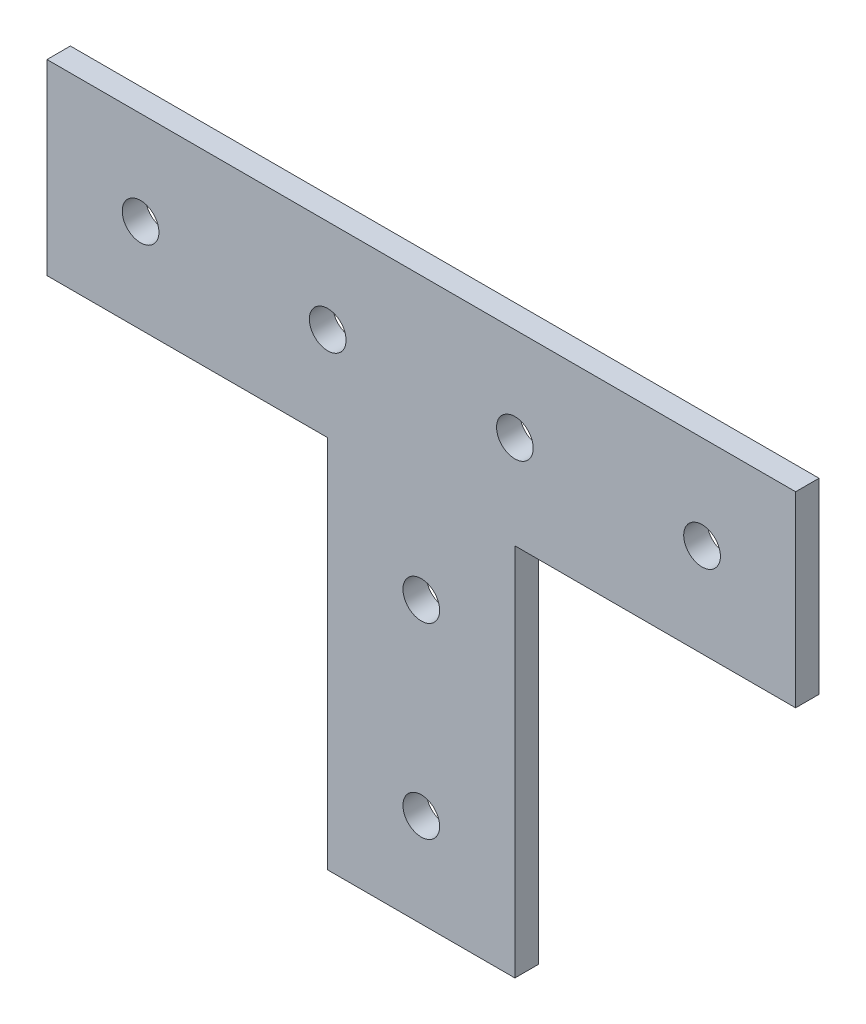
ISO-10303-21;
HEADER;
FILE_DESCRIPTION(('STEP AP214'),'2;1');
FILE_NAME('part.step','',(''),(''),'','','');
FILE_SCHEMA(('AUTOMOTIVE_DESIGN { 1 0 10303 214 1 1 1 1 }'));
ENDSEC;
DATA;
#1=APPLICATION_CONTEXT('core data for automotive mechanical design processes');
#2=APPLICATION_PROTOCOL_DEFINITION('international standard','automotive_design',2000,#1);
#3=PRODUCT_CONTEXT('',#1,'mechanical');
#4=PRODUCT('Part','Part','',(#3));
#5=PRODUCT_RELATED_PRODUCT_CATEGORY('part','',(#4));
#6=PRODUCT_DEFINITION_FORMATION('','',#4);
#7=PRODUCT_DEFINITION_CONTEXT('part definition',#1,'design');
#8=PRODUCT_DEFINITION('design','',#6,#7);
#9=PRODUCT_DEFINITION_SHAPE('','',#8);
#10=(LENGTH_UNIT() NAMED_UNIT(*) SI_UNIT(.MILLI.,.METRE.));
#11=(NAMED_UNIT(*) PLANE_ANGLE_UNIT() SI_UNIT($,.RADIAN.));
#12=(NAMED_UNIT(*) SI_UNIT($,.STERADIAN.) SOLID_ANGLE_UNIT());
#13=UNCERTAINTY_MEASURE_WITH_UNIT(LENGTH_MEASURE(1.E-05),#10,'distance_accuracy_value','');
#14=(GEOMETRIC_REPRESENTATION_CONTEXT(3) GLOBAL_UNCERTAINTY_ASSIGNED_CONTEXT((#13)) GLOBAL_UNIT_ASSIGNED_CONTEXT((#10,
#11,#12)) REPRESENTATION_CONTEXT('',''));
#15=CARTESIAN_POINT('',(0.,0.,0.));
#16=DIRECTION('',(0.,0.,1.));
#17=DIRECTION('',(1.,0.,0.));
#18=AXIS2_PLACEMENT_3D('',#15,#16,#17);
#19=CARTESIAN_POINT('',(0.,50.8,3.175));
#20=DIRECTION('',(0.,-1.,0.));
#21=DIRECTION('',(1.,0.,0.));
#22=AXIS2_PLACEMENT_3D('',#19,#20,#21);
#23=PLANE('',#22);
#24=DIRECTION('',(-1.,0.,0.));
#25=VECTOR('',#24,1.);
#26=CARTESIAN_POINT('',(0.,50.8,0.));
#27=LINE('',#26,#25);
#28=CARTESIAN_POINT('',(50.8,50.8,0.));
#29=VERTEX_POINT('',#28);
#30=CARTESIAN_POINT('',(-50.8,50.8,0.));
#31=VERTEX_POINT('',#30);
#32=EDGE_CURVE('E192',#29,#31,#27,.T.);
#33=ORIENTED_EDGE('',*,*,#32,.T.);
#34=DIRECTION('',(0.,0.,-1.));
#35=VECTOR('',#34,1.);
#36=CARTESIAN_POINT('',(-50.8,50.8,3.175));
#37=LINE('',#36,#35);
#38=CARTESIAN_POINT('',(-50.8,50.8,3.175));
#39=VERTEX_POINT('',#38);
#40=EDGE_CURVE('E11',#39,#31,#37,.T.);
#41=ORIENTED_EDGE('',*,*,#40,.F.);
#42=DIRECTION('',(-1.,0.,0.));
#43=VECTOR('',#42,1.);
#44=CARTESIAN_POINT('',(0.,50.8,3.175));
#45=LINE('',#44,#43);
#46=CARTESIAN_POINT('',(50.8,50.8,3.175));
#47=VERTEX_POINT('',#46);
#48=EDGE_CURVE('E140',#47,#39,#45,.T.);
#49=ORIENTED_EDGE('',*,*,#48,.F.);
#50=DIRECTION('',(0.,0.,-1.));
#51=VECTOR('',#50,1.);
#52=CARTESIAN_POINT('',(50.8,50.8,3.175));
#53=LINE('',#52,#51);
#54=EDGE_CURVE('E166',#47,#29,#53,.T.);
#55=ORIENTED_EDGE('',*,*,#54,.T.);
#56=EDGE_LOOP('',(#33,#41,#49,#55));
#57=FACE_BOUND('',#56,.T.);
#58=ADVANCED_FACE('F36',(#57),#23,.F.);
#59=CARTESIAN_POINT('',(-50.8,0.,3.175));
#60=DIRECTION('',(1.,0.,0.));
#61=DIRECTION('',(0.,0.,-1.));
#62=AXIS2_PLACEMENT_3D('',#59,#60,#61);
#63=PLANE('',#62);
#64=DIRECTION('',(0.,-1.,0.));
#65=VECTOR('',#64,1.);
#66=CARTESIAN_POINT('',(-50.8,0.,0.));
#67=LINE('',#66,#65);
#68=CARTESIAN_POINT('',(-50.8,25.4,0.));
#69=VERTEX_POINT('',#68);
#70=EDGE_CURVE('E185',#31,#69,#67,.T.);
#71=ORIENTED_EDGE('',*,*,#70,.T.);
#72=DIRECTION('',(0.,0.,-1.));
#73=VECTOR('',#72,1.);
#74=CARTESIAN_POINT('',(-50.8,25.4,3.175));
#75=LINE('',#74,#73);
#76=CARTESIAN_POINT('',(-50.8,25.4,3.175));
#77=VERTEX_POINT('',#76);
#78=EDGE_CURVE('E45',#77,#69,#75,.T.);
#79=ORIENTED_EDGE('',*,*,#78,.F.);
#80=DIRECTION('',(0.,-1.,0.));
#81=VECTOR('',#80,1.);
#82=CARTESIAN_POINT('',(-50.8,0.,3.175));
#83=LINE('',#82,#81);
#84=EDGE_CURVE('E96',#39,#77,#83,.T.);
#85=ORIENTED_EDGE('',*,*,#84,.F.);
#86=ORIENTED_EDGE('',*,*,#40,.T.);
#87=EDGE_LOOP('',(#71,#79,#85,#86));
#88=FACE_BOUND('',#87,.T.);
#89=ADVANCED_FACE('F240',(#88),#63,.F.);
#90=CARTESIAN_POINT('',(0.,25.4,3.175));
#91=DIRECTION('',(0.,1.,0.));
#92=DIRECTION('',(0.,0.,1.));
#93=AXIS2_PLACEMENT_3D('',#90,#91,#92);
#94=PLANE('',#93);
#95=DIRECTION('',(1.,0.,0.));
#96=VECTOR('',#95,1.);
#97=CARTESIAN_POINT('',(0.,25.4,0.));
#98=LINE('',#97,#96);
#99=CARTESIAN_POINT('',(-12.7,25.4,0.));
#100=VERTEX_POINT('',#99);
#101=EDGE_CURVE('E179',#69,#100,#98,.T.);
#102=ORIENTED_EDGE('',*,*,#101,.T.);
#103=DIRECTION('',(0.,0.,-1.));
#104=VECTOR('',#103,1.);
#105=CARTESIAN_POINT('',(-12.7,25.4,3.175));
#106=LINE('',#105,#104);
#107=CARTESIAN_POINT('',(-12.7,25.4,3.175));
#108=VERTEX_POINT('',#107);
#109=EDGE_CURVE('E173',#108,#100,#106,.T.);
#110=ORIENTED_EDGE('',*,*,#109,.F.);
#111=DIRECTION('',(1.,0.,0.));
#112=VECTOR('',#111,1.);
#113=CARTESIAN_POINT('',(0.,25.4,3.175));
#114=LINE('',#113,#112);
#115=EDGE_CURVE('E131',#77,#108,#114,.T.);
#116=ORIENTED_EDGE('',*,*,#115,.F.);
#117=ORIENTED_EDGE('',*,*,#78,.T.);
#118=EDGE_LOOP('',(#102,#110,#116,#117));
#119=FACE_BOUND('',#118,.T.);
#120=ADVANCED_FACE('F178',(#119),#94,.F.);
#121=CARTESIAN_POINT('',(-12.7,0.,3.175));
#122=DIRECTION('',(-1.,0.,0.));
#123=DIRECTION('',(0.,0.,1.));
#124=AXIS2_PLACEMENT_3D('',#121,#122,#123);
#125=PLANE('',#124);
#126=DIRECTION('',(0.,1.,0.));
#127=VECTOR('',#126,1.);
#128=CARTESIAN_POINT('',(-12.7,0.,0.));
#129=LINE('',#128,#127);
#130=CARTESIAN_POINT('',(-12.7,-25.4,0.));
#131=VERTEX_POINT('',#130);
#132=EDGE_CURVE('E188',#131,#100,#129,.T.);
#133=ORIENTED_EDGE('',*,*,#132,.F.);
#134=DIRECTION('',(0.,0.,-1.));
#135=VECTOR('',#134,1.);
#136=CARTESIAN_POINT('',(-12.7,-25.4,3.175));
#137=LINE('',#136,#135);
#138=CARTESIAN_POINT('',(-12.7,-25.4,3.175));
#139=VERTEX_POINT('',#138);
#140=EDGE_CURVE('E171',#139,#131,#137,.T.);
#141=ORIENTED_EDGE('',*,*,#140,.F.);
#142=DIRECTION('',(0.,1.,0.));
#143=VECTOR('',#142,1.);
#144=CARTESIAN_POINT('',(-12.7,0.,3.175));
#145=LINE('',#144,#143);
#146=EDGE_CURVE('E136',#139,#108,#145,.T.);
#147=ORIENTED_EDGE('',*,*,#146,.T.);
#148=ORIENTED_EDGE('',*,*,#109,.T.);
#149=EDGE_LOOP('',(#133,#141,#147,#148));
#150=FACE_BOUND('',#149,.T.);
#151=ADVANCED_FACE('F348',(#150),#125,.T.);
#152=CARTESIAN_POINT('',(0.,-25.4,3.175));
#153=DIRECTION('',(0.,1.,0.));
#154=DIRECTION('',(0.,0.,1.));
#155=AXIS2_PLACEMENT_3D('',#152,#153,#154);
#156=PLANE('',#155);
#157=DIRECTION('',(1.,0.,0.));
#158=VECTOR('',#157,1.);
#159=CARTESIAN_POINT('',(0.,-25.4,0.));
#160=LINE('',#159,#158);
#161=CARTESIAN_POINT('',(12.7,-25.4,0.));
#162=VERTEX_POINT('',#161);
#163=EDGE_CURVE('E190',#131,#162,#160,.T.);
#164=ORIENTED_EDGE('',*,*,#163,.T.);
#165=DIRECTION('',(0.,0.,-1.));
#166=VECTOR('',#165,1.);
#167=CARTESIAN_POINT('',(12.7,-25.4,3.175));
#168=LINE('',#167,#166);
#169=CARTESIAN_POINT('',(12.7,-25.4,3.175));
#170=VERTEX_POINT('',#169);
#171=EDGE_CURVE('E126',#170,#162,#168,.T.);
#172=ORIENTED_EDGE('',*,*,#171,.F.);
#173=DIRECTION('',(1.,0.,0.));
#174=VECTOR('',#173,1.);
#175=CARTESIAN_POINT('',(0.,-25.4,3.175));
#176=LINE('',#175,#174);
#177=EDGE_CURVE('E117',#139,#170,#176,.T.);
#178=ORIENTED_EDGE('',*,*,#177,.F.);
#179=ORIENTED_EDGE('',*,*,#140,.T.);
#180=EDGE_LOOP('',(#164,#172,#178,#179));
#181=FACE_BOUND('',#180,.T.);
#182=ADVANCED_FACE('F197',(#181),#156,.F.);
#183=CARTESIAN_POINT('',(12.7,0.,3.175));
#184=DIRECTION('',(-1.,0.,0.));
#185=DIRECTION('',(0.,0.,1.));
#186=AXIS2_PLACEMENT_3D('',#183,#184,#185);
#187=PLANE('',#186);
#188=DIRECTION('',(0.,1.,0.));
#189=VECTOR('',#188,1.);
#190=CARTESIAN_POINT('',(12.7,0.,0.));
#191=LINE('',#190,#189);
#192=CARTESIAN_POINT('',(12.7,25.4,0.));
#193=VERTEX_POINT('',#192);
#194=EDGE_CURVE('E125',#162,#193,#191,.T.);
#195=ORIENTED_EDGE('',*,*,#194,.T.);
#196=DIRECTION('',(0.,0.,-1.));
#197=VECTOR('',#196,1.);
#198=CARTESIAN_POINT('',(12.7,25.4,3.175));
#199=LINE('',#198,#197);
#200=CARTESIAN_POINT('',(12.7,25.4,3.175));
#201=VERTEX_POINT('',#200);
#202=EDGE_CURVE('E122',#201,#193,#199,.T.);
#203=ORIENTED_EDGE('',*,*,#202,.F.);
#204=DIRECTION('',(0.,1.,0.));
#205=VECTOR('',#204,1.);
#206=CARTESIAN_POINT('',(12.7,0.,3.175));
#207=LINE('',#206,#205);
#208=EDGE_CURVE('E109',#170,#201,#207,.T.);
#209=ORIENTED_EDGE('',*,*,#208,.F.);
#210=ORIENTED_EDGE('',*,*,#171,.T.);
#211=EDGE_LOOP('',(#195,#203,#209,#210));
#212=FACE_BOUND('',#211,.T.);
#213=ADVANCED_FACE('F123',(#212),#187,.F.);
#214=CARTESIAN_POINT('',(50.8,25.4,0.));
#215=VERTEX_POINT('',#214);
#216=EDGE_CURVE('E82',#193,#215,#98,.T.);
#217=ORIENTED_EDGE('',*,*,#216,.T.);
#218=DIRECTION('',(0.,0.,-1.));
#219=VECTOR('',#218,1.);
#220=CARTESIAN_POINT('',(50.8,25.4,3.175));
#221=LINE('',#220,#219);
#222=CARTESIAN_POINT('',(50.8,25.4,3.175));
#223=VERTEX_POINT('',#222);
#224=EDGE_CURVE('E127',#223,#215,#221,.T.);
#225=ORIENTED_EDGE('',*,*,#224,.F.);
#226=EDGE_CURVE('E114',#201,#223,#114,.T.);
#227=ORIENTED_EDGE('',*,*,#226,.F.);
#228=ORIENTED_EDGE('',*,*,#202,.T.);
#229=EDGE_LOOP('',(#217,#225,#227,#228));
#230=FACE_BOUND('',#229,.T.);
#231=ADVANCED_FACE('F129',(#230),#94,.F.);
#232=CARTESIAN_POINT('',(0.,-12.7,3.175));
#233=DIRECTION('',(0.,0.,-1.));
#234=DIRECTION('',(-1.,0.,0.));
#235=AXIS2_PLACEMENT_3D('',#232,#233,#234);
#236=CYLINDRICAL_SURFACE('',#235,2.4892);
#237=CARTESIAN_POINT('',(0.,-12.7,3.175));
#238=DIRECTION('',(0.,0.,1.));
#239=DIRECTION('',(1.,0.,0.));
#240=AXIS2_PLACEMENT_3D('',#237,#238,#239);
#241=CIRCLE('',#240,2.4892);
#242=CARTESIAN_POINT('',(2.4892,-12.7,3.175));
#243=VERTEX_POINT('',#242);
#244=EDGE_CURVE('E132',#243,#243,#241,.T.);
#245=ORIENTED_EDGE('',*,*,#244,.T.);
#246=EDGE_LOOP('',(#245));
#247=FACE_BOUND('',#246,.T.);
#248=CARTESIAN_POINT('',(0.,-12.7,0.));
#249=DIRECTION('',(0.,0.,1.));
#250=DIRECTION('',(1.,0.,0.));
#251=AXIS2_PLACEMENT_3D('',#248,#249,#250);
#252=CIRCLE('',#251,2.4892);
#253=CARTESIAN_POINT('',(2.4892,-12.7,0.));
#254=VERTEX_POINT('',#253);
#255=EDGE_CURVE('E158',#254,#254,#252,.T.);
#256=ORIENTED_EDGE('',*,*,#255,.F.);
#257=EDGE_LOOP('',(#256));
#258=FACE_BOUND('',#257,.T.);
#259=ADVANCED_FACE('F221',(#247,#258),#236,.F.);
#260=CARTESIAN_POINT('',(50.8,0.,3.175));
#261=DIRECTION('',(-1.,0.,0.));
#262=DIRECTION('',(0.,-1.,0.));
#263=AXIS2_PLACEMENT_3D('',#260,#261,#262);
#264=PLANE('',#263);
#265=DIRECTION('',(0.,1.,0.));
#266=VECTOR('',#265,1.);
#267=CARTESIAN_POINT('',(50.8,0.,0.));
#268=LINE('',#267,#266);
#269=EDGE_CURVE('E88',#215,#29,#268,.T.);
#270=ORIENTED_EDGE('',*,*,#269,.T.);
#271=ORIENTED_EDGE('',*,*,#54,.F.);
#272=DIRECTION('',(0.,1.,0.));
#273=VECTOR('',#272,1.);
#274=CARTESIAN_POINT('',(50.8,0.,3.175));
#275=LINE('',#274,#273);
#276=EDGE_CURVE('E53',#223,#47,#275,.T.);
#277=ORIENTED_EDGE('',*,*,#276,.F.);
#278=ORIENTED_EDGE('',*,*,#224,.T.);
#279=EDGE_LOOP('',(#270,#271,#277,#278));
#280=FACE_BOUND('',#279,.T.);
#281=ADVANCED_FACE('F252',(#280),#264,.F.);
#282=CARTESIAN_POINT('',(12.7,38.1,3.175));
#283=DIRECTION('',(0.,0.,-1.));
#284=DIRECTION('',(-1.,0.,0.));
#285=AXIS2_PLACEMENT_3D('',#282,#283,#284);
#286=CYLINDRICAL_SURFACE('',#285,2.4892);
#287=CARTESIAN_POINT('',(12.7,38.1,3.175));
#288=DIRECTION('',(0.,0.,1.));
#289=DIRECTION('',(1.,0.,0.));
#290=AXIS2_PLACEMENT_3D('',#287,#288,#289);
#291=CIRCLE('',#290,2.4892);
#292=CARTESIAN_POINT('',(15.1892,38.1,3.175));
#293=VERTEX_POINT('',#292);
#294=EDGE_CURVE('E141',#293,#293,#291,.T.);
#295=ORIENTED_EDGE('',*,*,#294,.T.);
#296=EDGE_LOOP('',(#295));
#297=FACE_BOUND('',#296,.T.);
#298=CARTESIAN_POINT('',(12.7,38.1,0.));
#299=DIRECTION('',(0.,0.,1.));
#300=DIRECTION('',(1.,0.,0.));
#301=AXIS2_PLACEMENT_3D('',#298,#299,#300);
#302=CIRCLE('',#301,2.4892);
#303=CARTESIAN_POINT('',(15.1892,38.1,0.));
#304=VERTEX_POINT('',#303);
#305=EDGE_CURVE('E201',#304,#304,#302,.T.);
#306=ORIENTED_EDGE('',*,*,#305,.F.);
#307=EDGE_LOOP('',(#306));
#308=FACE_BOUND('',#307,.T.);
#309=ADVANCED_FACE('F248',(#297,#308),#286,.F.);
#310=CARTESIAN_POINT('',(-12.7,38.1,3.175));
#311=DIRECTION('',(0.,0.,-1.));
#312=DIRECTION('',(-1.,0.,0.));
#313=AXIS2_PLACEMENT_3D('',#310,#311,#312);
#314=CYLINDRICAL_SURFACE('',#313,2.4892);
#315=CARTESIAN_POINT('',(-12.7,38.1,3.175));
#316=DIRECTION('',(0.,0.,1.));
#317=DIRECTION('',(1.,0.,0.));
#318=AXIS2_PLACEMENT_3D('',#315,#316,#317);
#319=CIRCLE('',#318,2.4892);
#320=CARTESIAN_POINT('',(-10.2108,38.1,3.175));
#321=VERTEX_POINT('',#320);
#322=EDGE_CURVE('E146',#321,#321,#319,.T.);
#323=ORIENTED_EDGE('',*,*,#322,.T.);
#324=EDGE_LOOP('',(#323));
#325=FACE_BOUND('',#324,.T.);
#326=CARTESIAN_POINT('',(-12.7,38.1,0.));
#327=DIRECTION('',(0.,0.,1.));
#328=DIRECTION('',(1.,0.,0.));
#329=AXIS2_PLACEMENT_3D('',#326,#327,#328);
#330=CIRCLE('',#329,2.4892);
#331=CARTESIAN_POINT('',(-10.2108,38.1,0.));
#332=VERTEX_POINT('',#331);
#333=EDGE_CURVE('E204',#332,#332,#330,.T.);
#334=ORIENTED_EDGE('',*,*,#333,.F.);
#335=EDGE_LOOP('',(#334));
#336=FACE_BOUND('',#335,.T.);
#337=ADVANCED_FACE('F251',(#325,#336),#314,.F.);
#338=CARTESIAN_POINT('',(-38.1,38.1,3.175));
#339=DIRECTION('',(0.,0.,-1.));
#340=DIRECTION('',(-1.,0.,0.));
#341=AXIS2_PLACEMENT_3D('',#338,#339,#340);
#342=CYLINDRICAL_SURFACE('',#341,2.4892);
#343=CARTESIAN_POINT('',(-38.1,38.1,3.175));
#344=DIRECTION('',(0.,0.,1.));
#345=DIRECTION('',(1.,0.,0.));
#346=AXIS2_PLACEMENT_3D('',#343,#344,#345);
#347=CIRCLE('',#346,2.4892);
#348=CARTESIAN_POINT('',(-35.6108,38.1,3.175));
#349=VERTEX_POINT('',#348);
#350=EDGE_CURVE('E149',#349,#349,#347,.T.);
#351=ORIENTED_EDGE('',*,*,#350,.T.);
#352=EDGE_LOOP('',(#351));
#353=FACE_BOUND('',#352,.T.);
#354=CARTESIAN_POINT('',(-38.1,38.1,0.));
#355=DIRECTION('',(0.,0.,1.));
#356=DIRECTION('',(1.,0.,0.));
#357=AXIS2_PLACEMENT_3D('',#354,#355,#356);
#358=CIRCLE('',#357,2.4892);
#359=CARTESIAN_POINT('',(-35.6108,38.1,0.));
#360=VERTEX_POINT('',#359);
#361=EDGE_CURVE('E209',#360,#360,#358,.T.);
#362=ORIENTED_EDGE('',*,*,#361,.F.);
#363=EDGE_LOOP('',(#362));
#364=FACE_BOUND('',#363,.T.);
#365=ADVANCED_FACE('F236',(#353,#364),#342,.F.);
#366=CARTESIAN_POINT('',(38.1,38.1,3.175));
#367=DIRECTION('',(0.,0.,-1.));
#368=DIRECTION('',(-1.,0.,0.));
#369=AXIS2_PLACEMENT_3D('',#366,#367,#368);
#370=CYLINDRICAL_SURFACE('',#369,2.4892);
#371=CARTESIAN_POINT('',(38.1,38.1,3.175));
#372=DIRECTION('',(0.,0.,1.));
#373=DIRECTION('',(1.,0.,0.));
#374=AXIS2_PLACEMENT_3D('',#371,#372,#373);
#375=CIRCLE('',#374,2.4892);
#376=CARTESIAN_POINT('',(40.5892,38.1,3.175));
#377=VERTEX_POINT('',#376);
#378=EDGE_CURVE('E152',#377,#377,#375,.T.);
#379=ORIENTED_EDGE('',*,*,#378,.T.);
#380=EDGE_LOOP('',(#379));
#381=FACE_BOUND('',#380,.T.);
#382=CARTESIAN_POINT('',(38.1,38.1,0.));
#383=DIRECTION('',(0.,0.,1.));
#384=DIRECTION('',(1.,0.,0.));
#385=AXIS2_PLACEMENT_3D('',#382,#383,#384);
#386=CIRCLE('',#385,2.4892);
#387=CARTESIAN_POINT('',(40.5892,38.1,0.));
#388=VERTEX_POINT('',#387);
#389=EDGE_CURVE('E212',#388,#388,#386,.T.);
#390=ORIENTED_EDGE('',*,*,#389,.F.);
#391=EDGE_LOOP('',(#390));
#392=FACE_BOUND('',#391,.T.);
#393=ADVANCED_FACE('F38',(#381,#392),#370,.F.);
#394=CARTESIAN_POINT('',(0.,12.7,3.175));
#395=DIRECTION('',(0.,0.,-1.));
#396=DIRECTION('',(-1.,0.,0.));
#397=AXIS2_PLACEMENT_3D('',#394,#395,#396);
#398=CYLINDRICAL_SURFACE('',#397,2.4892);
#399=CARTESIAN_POINT('',(0.,12.7,3.175));
#400=DIRECTION('',(0.,0.,1.));
#401=DIRECTION('',(1.,0.,0.));
#402=AXIS2_PLACEMENT_3D('',#399,#400,#401);
#403=CIRCLE('',#402,2.4892);
#404=CARTESIAN_POINT('',(2.4892,12.7,3.175));
#405=VERTEX_POINT('',#404);
#406=EDGE_CURVE('E168',#405,#405,#403,.T.);
#407=ORIENTED_EDGE('',*,*,#406,.T.);
#408=EDGE_LOOP('',(#407));
#409=FACE_BOUND('',#408,.T.);
#410=CARTESIAN_POINT('',(0.,12.7,0.));
#411=DIRECTION('',(0.,0.,1.));
#412=DIRECTION('',(1.,0.,0.));
#413=AXIS2_PLACEMENT_3D('',#410,#411,#412);
#414=CIRCLE('',#413,2.4892);
#415=CARTESIAN_POINT('',(2.4892,12.7,0.));
#416=VERTEX_POINT('',#415);
#417=EDGE_CURVE('E154',#416,#416,#414,.T.);
#418=ORIENTED_EDGE('',*,*,#417,.F.);
#419=EDGE_LOOP('',(#418));
#420=FACE_BOUND('',#419,.T.);
#421=ADVANCED_FACE('F225',(#409,#420),#398,.F.);
#422=CARTESIAN_POINT('',(0.,0.,3.175));
#423=DIRECTION('',(0.,0.,1.));
#424=DIRECTION('',(1.,0.,0.));
#425=AXIS2_PLACEMENT_3D('',#422,#423,#424);
#426=PLANE('',#425);
#427=ORIENTED_EDGE('',*,*,#378,.F.);
#428=EDGE_LOOP('',(#427));
#429=FACE_BOUND('',#428,.T.);
#430=ORIENTED_EDGE('',*,*,#350,.F.);
#431=EDGE_LOOP('',(#430));
#432=FACE_BOUND('',#431,.T.);
#433=ORIENTED_EDGE('',*,*,#322,.F.);
#434=EDGE_LOOP('',(#433));
#435=FACE_BOUND('',#434,.T.);
#436=ORIENTED_EDGE('',*,*,#294,.F.);
#437=EDGE_LOOP('',(#436));
#438=FACE_BOUND('',#437,.T.);
#439=ORIENTED_EDGE('',*,*,#48,.T.);
#440=ORIENTED_EDGE('',*,*,#84,.T.);
#441=ORIENTED_EDGE('',*,*,#115,.T.);
#442=ORIENTED_EDGE('',*,*,#146,.F.);
#443=ORIENTED_EDGE('',*,*,#177,.T.);
#444=ORIENTED_EDGE('',*,*,#208,.T.);
#445=ORIENTED_EDGE('',*,*,#226,.T.);
#446=ORIENTED_EDGE('',*,*,#276,.T.);
#447=EDGE_LOOP('',(#439,#440,#441,#442,#443,#444,#445,#446));
#448=FACE_BOUND('',#447,.T.);
#449=ORIENTED_EDGE('',*,*,#244,.F.);
#450=EDGE_LOOP('',(#449));
#451=FACE_BOUND('',#450,.T.);
#452=ORIENTED_EDGE('',*,*,#406,.F.);
#453=EDGE_LOOP('',(#452));
#454=FACE_BOUND('',#453,.T.);
#455=ADVANCED_FACE('F111',(#429,#432,#435,#438,#448,#451,#454),#426,.T.);
#456=CARTESIAN_POINT('',(0.,0.,0.));
#457=DIRECTION('',(0.,0.,1.));
#458=DIRECTION('',(1.,0.,0.));
#459=AXIS2_PLACEMENT_3D('',#456,#457,#458);
#460=PLANE('',#459);
#461=ORIENTED_EDGE('',*,*,#389,.T.);
#462=EDGE_LOOP('',(#461));
#463=FACE_BOUND('',#462,.T.);
#464=ORIENTED_EDGE('',*,*,#361,.T.);
#465=EDGE_LOOP('',(#464));
#466=FACE_BOUND('',#465,.T.);
#467=ORIENTED_EDGE('',*,*,#333,.T.);
#468=EDGE_LOOP('',(#467));
#469=FACE_BOUND('',#468,.T.);
#470=ORIENTED_EDGE('',*,*,#305,.T.);
#471=EDGE_LOOP('',(#470));
#472=FACE_BOUND('',#471,.T.);
#473=ORIENTED_EDGE('',*,*,#32,.F.);
#474=ORIENTED_EDGE('',*,*,#269,.F.);
#475=ORIENTED_EDGE('',*,*,#216,.F.);
#476=ORIENTED_EDGE('',*,*,#194,.F.);
#477=ORIENTED_EDGE('',*,*,#163,.F.);
#478=ORIENTED_EDGE('',*,*,#132,.T.);
#479=ORIENTED_EDGE('',*,*,#101,.F.);
#480=ORIENTED_EDGE('',*,*,#70,.F.);
#481=EDGE_LOOP('',(#473,#474,#475,#476,#477,#478,#479,#480));
#482=FACE_BOUND('',#481,.T.);
#483=ORIENTED_EDGE('',*,*,#255,.T.);
#484=EDGE_LOOP('',(#483));
#485=FACE_BOUND('',#484,.T.);
#486=ORIENTED_EDGE('',*,*,#417,.T.);
#487=EDGE_LOOP('',(#486));
#488=FACE_BOUND('',#487,.T.);
#489=ADVANCED_FACE('F183',(#463,#466,#469,#472,#482,#485,#488),#460,.F.);
#490=CLOSED_SHELL('',(#58,#89,#120,#151,#182,#213,#231,#259,#281,#309,#337,#365,#393,#421,#455,#489));
#491=MANIFOLD_SOLID_BREP('B2',#490);
#492=ADVANCED_BREP_SHAPE_REPRESENTATION('',(#18,#491),#14);
#493=SHAPE_DEFINITION_REPRESENTATION(#9,#492);
ENDSEC;
END-ISO-10303-21;
